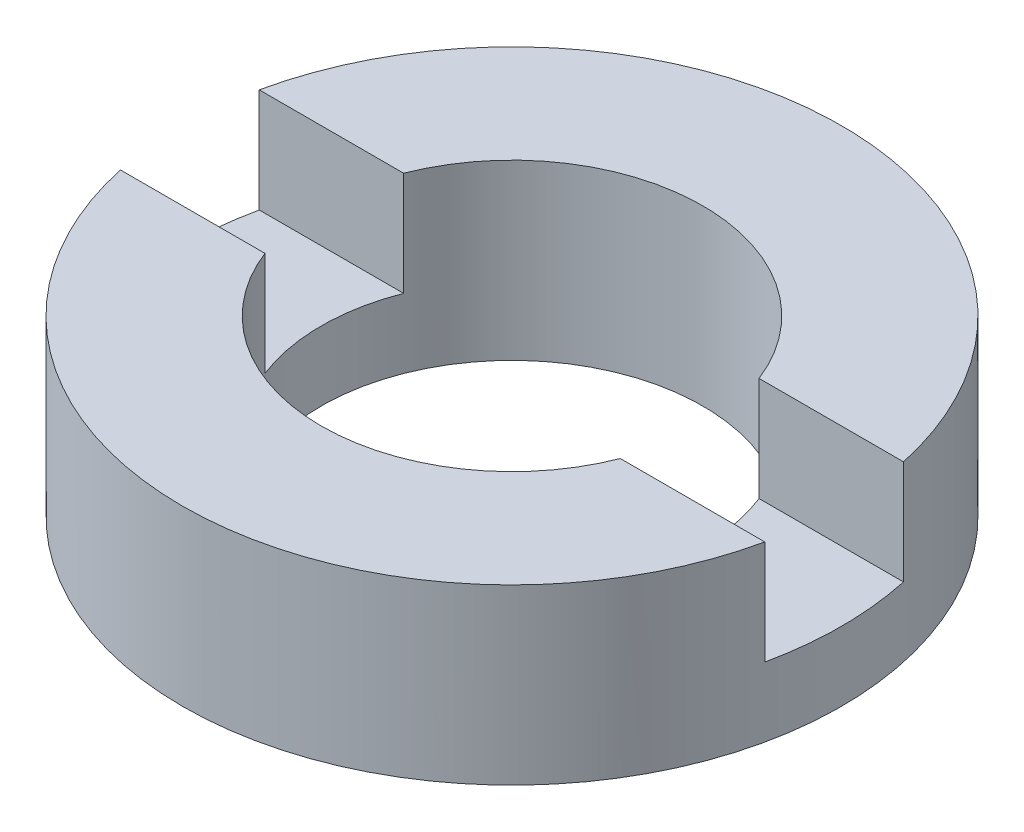
ISO-10303-21;
HEADER;
FILE_DESCRIPTION(('STEP AP214'),'2;1');
FILE_NAME('part.step','',(''),(''),'','','');
FILE_SCHEMA(('AUTOMOTIVE_DESIGN { 1 0 10303 214 1 1 1 1 }'));
ENDSEC;
DATA;
#1=APPLICATION_CONTEXT('core data for automotive mechanical design processes');
#2=APPLICATION_PROTOCOL_DEFINITION('international standard','automotive_design',2000,#1);
#3=PRODUCT_CONTEXT('',#1,'mechanical');
#4=PRODUCT('Part','Part','',(#3));
#5=PRODUCT_RELATED_PRODUCT_CATEGORY('part','',(#4));
#6=PRODUCT_DEFINITION_FORMATION('','',#4);
#7=PRODUCT_DEFINITION_CONTEXT('part definition',#1,'design');
#8=PRODUCT_DEFINITION('design','',#6,#7);
#9=PRODUCT_DEFINITION_SHAPE('','',#8);
#10=(LENGTH_UNIT() NAMED_UNIT(*) SI_UNIT(.MILLI.,.METRE.));
#11=(NAMED_UNIT(*) PLANE_ANGLE_UNIT() SI_UNIT($,.RADIAN.));
#12=(NAMED_UNIT(*) SI_UNIT($,.STERADIAN.) SOLID_ANGLE_UNIT());
#13=UNCERTAINTY_MEASURE_WITH_UNIT(LENGTH_MEASURE(1.E-05),#10,'distance_accuracy_value','');
#14=(GEOMETRIC_REPRESENTATION_CONTEXT(3) GLOBAL_UNCERTAINTY_ASSIGNED_CONTEXT((#13)) GLOBAL_UNIT_ASSIGNED_CONTEXT((#10,
#11,#12)) REPRESENTATION_CONTEXT('',''));
#15=CARTESIAN_POINT('',(0.,0.,0.));
#16=DIRECTION('',(0.,0.,1.));
#17=DIRECTION('',(1.,0.,0.));
#18=AXIS2_PLACEMENT_3D('',#15,#16,#17);
#19=CARTESIAN_POINT('',(2.75000000000001,-1.96424978717943,0.));
#20=DIRECTION('',(0.,-1.,0.));
#21=DIRECTION('',(0.,0.,-1.));
#22=AXIS2_PLACEMENT_3D('',#19,#20,#21);
#23=PLANE('',#22);
#24=CARTESIAN_POINT('',(0.,-1.96424978717943,0.));
#25=DIRECTION('',(0.,1.,0.));
#26=DIRECTION('',(0.,0.,1.));
#27=AXIS2_PLACEMENT_3D('',#24,#25,#26);
#28=CIRCLE('',#27,4.75000000000001);
#29=CARTESIAN_POINT('',(-4.64354390525169,-1.96424978717943,1.));
#30=VERTEX_POINT('',#29);
#31=CARTESIAN_POINT('',(4.64354390525167,-1.96424978717943,1.));
#32=VERTEX_POINT('',#31);
#33=EDGE_CURVE('E127',#30,#32,#28,.T.);
#34=ORIENTED_EDGE('',*,*,#33,.T.);
#35=DIRECTION('',(1.,0.,0.));
#36=VECTOR('',#35,1.);
#37=CARTESIAN_POINT('',(-26.8525402726146,-1.96424978717943,1.));
#38=LINE('',#37,#36);
#39=CARTESIAN_POINT('',(2.56173769148991,-1.96424978717943,1.));
#40=VERTEX_POINT('',#39);
#41=EDGE_CURVE('E120',#40,#32,#38,.T.);
#42=ORIENTED_EDGE('',*,*,#41,.F.);
#43=CARTESIAN_POINT('',(0.,-1.96424978717943,0.));
#44=DIRECTION('',(0.,1.,0.));
#45=DIRECTION('',(0.,0.,1.));
#46=AXIS2_PLACEMENT_3D('',#43,#44,#45);
#47=CIRCLE('',#46,2.75000000000001);
#48=CARTESIAN_POINT('',(-2.56173769148991,-1.96424978717943,1.));
#49=VERTEX_POINT('',#48);
#50=EDGE_CURVE('E134',#49,#40,#47,.T.);
#51=ORIENTED_EDGE('',*,*,#50,.F.);
#52=EDGE_CURVE('E149',#30,#49,#38,.T.);
#53=ORIENTED_EDGE('',*,*,#52,.F.);
#54=EDGE_LOOP('',(#34,#42,#51,#53));
#55=FACE_BOUND('',#54,.T.);
#56=ADVANCED_FACE('F37',(#55),#23,.F.);
#57=CARTESIAN_POINT('',(0.,56.2608426270136,0.));
#58=DIRECTION('',(0.,1.,0.));
#59=DIRECTION('',(0.,0.,1.));
#60=AXIS2_PLACEMENT_3D('',#57,#58,#59);
#61=CYLINDRICAL_SURFACE('',#60,4.75000000000001);
#62=CARTESIAN_POINT('',(0.,-3.46424978717943,0.));
#63=DIRECTION('',(0.,1.,0.));
#64=DIRECTION('',(0.,0.,1.));
#65=AXIS2_PLACEMENT_3D('',#62,#63,#64);
#66=CIRCLE('',#65,4.75000000000001);
#67=CARTESIAN_POINT('',(4.64354390525168,-3.46424978717943,1.));
#68=VERTEX_POINT('',#67);
#69=CARTESIAN_POINT('',(4.64354390525168,-3.46424978717943,-1.));
#70=VERTEX_POINT('',#69);
#71=EDGE_CURVE('E110',#68,#70,#66,.T.);
#72=ORIENTED_EDGE('',*,*,#71,.F.);
#73=DIRECTION('',(0.,1.,0.));
#74=VECTOR('',#73,1.);
#75=CARTESIAN_POINT('',(4.64354390525169,56.2608426270136,1.));
#76=LINE('',#75,#74);
#77=EDGE_CURVE('E162',#68,#32,#76,.T.);
#78=ORIENTED_EDGE('',*,*,#77,.T.);
#79=ORIENTED_EDGE('',*,*,#33,.F.);
#80=DIRECTION('',(0.,1.,0.));
#81=VECTOR('',#80,1.);
#82=CARTESIAN_POINT('',(-4.64354390525169,56.2608426270136,1.));
#83=LINE('',#82,#81);
#84=CARTESIAN_POINT('',(-4.64354390525168,-3.46424978717943,1.));
#85=VERTEX_POINT('',#84);
#86=EDGE_CURVE('E159',#30,#85,#83,.F.);
#87=ORIENTED_EDGE('',*,*,#86,.T.);
#88=CARTESIAN_POINT('',(-4.64354390525168,-3.46424978717943,-1.));
#89=VERTEX_POINT('',#88);
#90=EDGE_CURVE('E156',#89,#85,#66,.T.);
#91=ORIENTED_EDGE('',*,*,#90,.F.);
#92=DIRECTION('',(0.,1.,0.));
#93=VECTOR('',#92,1.);
#94=CARTESIAN_POINT('',(-4.64354390525169,56.2608426270136,-1.));
#95=LINE('',#94,#93);
#96=CARTESIAN_POINT('',(-4.64354390525169,-1.96424978717943,-1.));
#97=VERTEX_POINT('',#96);
#98=EDGE_CURVE('E109',#89,#97,#95,.T.);
#99=ORIENTED_EDGE('',*,*,#98,.T.);
#100=CARTESIAN_POINT('',(4.64354390525167,-1.96424978717943,-1.));
#101=VERTEX_POINT('',#100);
#102=EDGE_CURVE('E117',#101,#97,#28,.T.);
#103=ORIENTED_EDGE('',*,*,#102,.F.);
#104=DIRECTION('',(0.,1.,0.));
#105=VECTOR('',#104,1.);
#106=CARTESIAN_POINT('',(4.64354390525169,56.2608426270136,-1.));
#107=LINE('',#106,#105);
#108=EDGE_CURVE('E101',#101,#70,#107,.F.);
#109=ORIENTED_EDGE('',*,*,#108,.T.);
#110=EDGE_LOOP('',(#72,#78,#79,#87,#91,#99,#103,#109));
#111=FACE_BOUND('',#110,.T.);
#112=CARTESIAN_POINT('',(0.,-4.46424978717943,0.));
#113=DIRECTION('',(0.,1.,0.));
#114=DIRECTION('',(0.,0.,1.));
#115=AXIS2_PLACEMENT_3D('',#112,#113,#114);
#116=CIRCLE('',#115,4.75000000000001);
#117=CARTESIAN_POINT('',(0.,-4.46424978717943,4.75000000000001));
#118=VERTEX_POINT('',#117);
#119=EDGE_CURVE('E165',#118,#118,#116,.T.);
#120=ORIENTED_EDGE('',*,*,#119,.T.);
#121=EDGE_LOOP('',(#120));
#122=FACE_BOUND('',#121,.T.);
#123=ADVANCED_FACE('F39',(#111,#122),#61,.T.);
#124=ORIENTED_EDGE('',*,*,#102,.T.);
#125=DIRECTION('',(-1.,0.,0.));
#126=VECTOR('',#125,1.);
#127=CARTESIAN_POINT('',(-26.8525402726146,-1.96424978717943,-1.));
#128=LINE('',#127,#126);
#129=CARTESIAN_POINT('',(-2.56173769148991,-1.96424978717943,-1.));
#130=VERTEX_POINT('',#129);
#131=EDGE_CURVE('E121',#130,#97,#128,.T.);
#132=ORIENTED_EDGE('',*,*,#131,.F.);
#133=CARTESIAN_POINT('',(2.56173769148991,-1.96424978717943,-1.));
#134=VERTEX_POINT('',#133);
#135=EDGE_CURVE('E119',#134,#130,#47,.T.);
#136=ORIENTED_EDGE('',*,*,#135,.F.);
#137=EDGE_CURVE('E104',#101,#134,#128,.T.);
#138=ORIENTED_EDGE('',*,*,#137,.F.);
#139=EDGE_LOOP('',(#124,#132,#136,#138));
#140=FACE_BOUND('',#139,.T.);
#141=ADVANCED_FACE('F115',(#140),#23,.F.);
#142=CARTESIAN_POINT('',(0.,56.2608426270136,0.));
#143=DIRECTION('',(0.,1.,0.));
#144=DIRECTION('',(0.,0.,1.));
#145=AXIS2_PLACEMENT_3D('',#142,#143,#144);
#146=CYLINDRICAL_SURFACE('',#145,2.75000000000001);
#147=CARTESIAN_POINT('',(0.,-3.46424978717943,0.));
#148=DIRECTION('',(0.,1.,0.));
#149=DIRECTION('',(0.,0.,1.));
#150=AXIS2_PLACEMENT_3D('',#147,#148,#149);
#151=CIRCLE('',#150,2.75000000000001);
#152=CARTESIAN_POINT('',(-2.56173769148991,-3.46424978717943,1.));
#153=VERTEX_POINT('',#152);
#154=CARTESIAN_POINT('',(-2.56173769148991,-3.46424978717943,-1.));
#155=VERTEX_POINT('',#154);
#156=EDGE_CURVE('E131',#153,#155,#151,.F.);
#157=ORIENTED_EDGE('',*,*,#156,.F.);
#158=DIRECTION('',(0.,1.,0.));
#159=VECTOR('',#158,1.);
#160=CARTESIAN_POINT('',(-2.56173769148991,56.2608426270136,1.));
#161=LINE('',#160,#159);
#162=EDGE_CURVE('E11',#153,#49,#161,.T.);
#163=ORIENTED_EDGE('',*,*,#162,.T.);
#164=ORIENTED_EDGE('',*,*,#50,.T.);
#165=DIRECTION('',(0.,1.,0.));
#166=VECTOR('',#165,1.);
#167=CARTESIAN_POINT('',(2.56173769148991,56.2608426270136,1.));
#168=LINE('',#167,#166);
#169=CARTESIAN_POINT('',(2.56173769148991,-3.46424978717943,1.));
#170=VERTEX_POINT('',#169);
#171=EDGE_CURVE('E138',#40,#170,#168,.F.);
#172=ORIENTED_EDGE('',*,*,#171,.T.);
#173=CARTESIAN_POINT('',(2.56173769148991,-3.46424978717943,-1.));
#174=VERTEX_POINT('',#173);
#175=EDGE_CURVE('E126',#174,#170,#151,.F.);
#176=ORIENTED_EDGE('',*,*,#175,.F.);
#177=DIRECTION('',(0.,1.,0.));
#178=VECTOR('',#177,1.);
#179=CARTESIAN_POINT('',(2.56173769148991,56.2608426270136,-1.));
#180=LINE('',#179,#178);
#181=EDGE_CURVE('E129',#174,#134,#180,.T.);
#182=ORIENTED_EDGE('',*,*,#181,.T.);
#183=ORIENTED_EDGE('',*,*,#135,.T.);
#184=DIRECTION('',(0.,1.,0.));
#185=VECTOR('',#184,1.);
#186=CARTESIAN_POINT('',(-2.56173769148991,56.2608426270136,-1.));
#187=LINE('',#186,#185);
#188=EDGE_CURVE('E45',#130,#155,#187,.F.);
#189=ORIENTED_EDGE('',*,*,#188,.T.);
#190=EDGE_LOOP('',(#157,#163,#164,#172,#176,#182,#183,#189));
#191=FACE_BOUND('',#190,.T.);
#192=CARTESIAN_POINT('',(0.,-4.46424978717943,0.));
#193=DIRECTION('',(0.,1.,0.));
#194=DIRECTION('',(0.,0.,1.));
#195=AXIS2_PLACEMENT_3D('',#192,#193,#194);
#196=CIRCLE('',#195,2.75000000000001);
#197=CARTESIAN_POINT('',(0.,-4.46424978717943,2.75000000000001));
#198=VERTEX_POINT('',#197);
#199=EDGE_CURVE('E167',#198,#198,#196,.T.);
#200=ORIENTED_EDGE('',*,*,#199,.F.);
#201=EDGE_LOOP('',(#200));
#202=FACE_BOUND('',#201,.T.);
#203=ADVANCED_FACE('F173',(#191,#202),#146,.F.);
#204=CARTESIAN_POINT('',(2.75000000000001,-4.46424978717943,0.));
#205=DIRECTION('',(0.,1.,0.));
#206=DIRECTION('',(0.,0.,1.));
#207=AXIS2_PLACEMENT_3D('',#204,#205,#206);
#208=PLANE('',#207);
#209=ORIENTED_EDGE('',*,*,#119,.F.);
#210=EDGE_LOOP('',(#209));
#211=FACE_BOUND('',#210,.T.);
#212=ORIENTED_EDGE('',*,*,#199,.T.);
#213=EDGE_LOOP('',(#212));
#214=FACE_BOUND('',#213,.T.);
#215=ADVANCED_FACE('F203',(#211,#214),#208,.F.);
#216=CARTESIAN_POINT('',(0.,-3.46424978717943,0.));
#217=DIRECTION('',(0.,1.,0.));
#218=DIRECTION('',(0.,0.,1.));
#219=AXIS2_PLACEMENT_3D('',#216,#217,#218);
#220=PLANE('',#219);
#221=ORIENTED_EDGE('',*,*,#71,.T.);
#222=DIRECTION('',(-1.,0.,0.));
#223=VECTOR('',#222,1.);
#224=CARTESIAN_POINT('',(-26.8525402726146,-3.46424978717943,-1.));
#225=LINE('',#224,#223);
#226=EDGE_CURVE('E60',#70,#174,#225,.T.);
#227=ORIENTED_EDGE('',*,*,#226,.T.);
#228=ORIENTED_EDGE('',*,*,#175,.T.);
#229=DIRECTION('',(1.,0.,0.));
#230=VECTOR('',#229,1.);
#231=CARTESIAN_POINT('',(-26.8525402726146,-3.46424978717943,1.));
#232=LINE('',#231,#230);
#233=EDGE_CURVE('E151',#170,#68,#232,.T.);
#234=ORIENTED_EDGE('',*,*,#233,.T.);
#235=EDGE_LOOP('',(#221,#227,#228,#234));
#236=FACE_BOUND('',#235,.T.);
#237=ADVANCED_FACE('F177',(#236),#220,.T.);
#238=CARTESIAN_POINT('',(-26.8525402726146,-3.46424978717943,-1.));
#239=DIRECTION('',(0.,0.,-1.));
#240=DIRECTION('',(-1.,0.,0.));
#241=AXIS2_PLACEMENT_3D('',#238,#239,#240);
#242=PLANE('',#241);
#243=ORIENTED_EDGE('',*,*,#137,.T.);
#244=ORIENTED_EDGE('',*,*,#181,.F.);
#245=ORIENTED_EDGE('',*,*,#226,.F.);
#246=ORIENTED_EDGE('',*,*,#108,.F.);
#247=EDGE_LOOP('',(#243,#244,#245,#246));
#248=FACE_BOUND('',#247,.T.);
#249=ADVANCED_FACE('F103',(#248),#242,.F.);
#250=CARTESIAN_POINT('',(-26.8525402726146,-3.46424978717943,1.));
#251=DIRECTION('',(0.,0.,1.));
#252=DIRECTION('',(1.,0.,0.));
#253=AXIS2_PLACEMENT_3D('',#250,#251,#252);
#254=PLANE('',#253);
#255=ORIENTED_EDGE('',*,*,#233,.F.);
#256=ORIENTED_EDGE('',*,*,#171,.F.);
#257=ORIENTED_EDGE('',*,*,#41,.T.);
#258=ORIENTED_EDGE('',*,*,#77,.F.);
#259=EDGE_LOOP('',(#255,#256,#257,#258));
#260=FACE_BOUND('',#259,.T.);
#261=ADVANCED_FACE('F179',(#260),#254,.F.);
#262=ORIENTED_EDGE('',*,*,#52,.T.);
#263=ORIENTED_EDGE('',*,*,#162,.F.);
#264=EDGE_CURVE('E52',#85,#153,#232,.T.);
#265=ORIENTED_EDGE('',*,*,#264,.F.);
#266=ORIENTED_EDGE('',*,*,#86,.F.);
#267=EDGE_LOOP('',(#262,#263,#265,#266));
#268=FACE_BOUND('',#267,.T.);
#269=ADVANCED_FACE('F185',(#268),#254,.F.);
#270=EDGE_CURVE('E146',#155,#89,#225,.T.);
#271=ORIENTED_EDGE('',*,*,#270,.F.);
#272=ORIENTED_EDGE('',*,*,#188,.F.);
#273=ORIENTED_EDGE('',*,*,#131,.T.);
#274=ORIENTED_EDGE('',*,*,#98,.F.);
#275=EDGE_LOOP('',(#271,#272,#273,#274));
#276=FACE_BOUND('',#275,.T.);
#277=ADVANCED_FACE('F148',(#276),#242,.F.);
#278=ORIENTED_EDGE('',*,*,#90,.T.);
#279=ORIENTED_EDGE('',*,*,#264,.T.);
#280=ORIENTED_EDGE('',*,*,#156,.T.);
#281=ORIENTED_EDGE('',*,*,#270,.T.);
#282=EDGE_LOOP('',(#278,#279,#280,#281));
#283=FACE_BOUND('',#282,.T.);
#284=ADVANCED_FACE('F145',(#283),#220,.T.);
#285=CLOSED_SHELL('',(#56,#123,#141,#203,#215,#237,#249,#261,#269,#277,#284));
#286=MANIFOLD_SOLID_BREP('B2',#285);
#287=ADVANCED_BREP_SHAPE_REPRESENTATION('',(#18,#286),#14);
#288=SHAPE_DEFINITION_REPRESENTATION(#9,#287);
ENDSEC;
END-ISO-10303-21;
